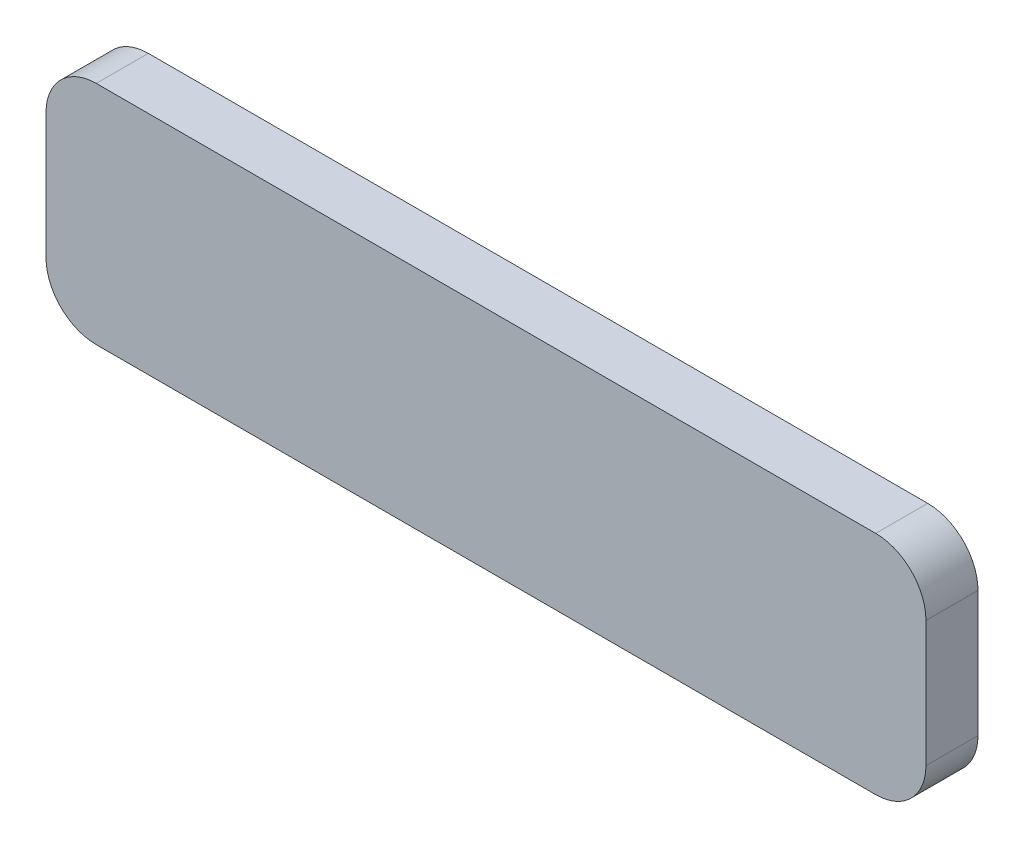
ISO-10303-21;
HEADER;
FILE_DESCRIPTION(('STEP AP214'),'2;1');
FILE_NAME('part.step','',(''),(''),'','','');
FILE_SCHEMA(('AUTOMOTIVE_DESIGN { 1 0 10303 214 1 1 1 1 }'));
ENDSEC;
DATA;
#1=APPLICATION_CONTEXT('core data for automotive mechanical design processes');
#2=APPLICATION_PROTOCOL_DEFINITION('international standard','automotive_design',2000,#1);
#3=PRODUCT_CONTEXT('',#1,'mechanical');
#4=PRODUCT('Part','Part','',(#3));
#5=PRODUCT_RELATED_PRODUCT_CATEGORY('part','',(#4));
#6=PRODUCT_DEFINITION_FORMATION('','',#4);
#7=PRODUCT_DEFINITION_CONTEXT('part definition',#1,'design');
#8=PRODUCT_DEFINITION('design','',#6,#7);
#9=PRODUCT_DEFINITION_SHAPE('','',#8);
#10=(LENGTH_UNIT() NAMED_UNIT(*) SI_UNIT(.MILLI.,.METRE.));
#11=(NAMED_UNIT(*) PLANE_ANGLE_UNIT() SI_UNIT($,.RADIAN.));
#12=(NAMED_UNIT(*) SI_UNIT($,.STERADIAN.) SOLID_ANGLE_UNIT());
#13=UNCERTAINTY_MEASURE_WITH_UNIT(LENGTH_MEASURE(1.E-05),#10,'distance_accuracy_value','');
#14=(GEOMETRIC_REPRESENTATION_CONTEXT(3) GLOBAL_UNCERTAINTY_ASSIGNED_CONTEXT((#13)) GLOBAL_UNIT_ASSIGNED_CONTEXT((#10,
#11,#12)) REPRESENTATION_CONTEXT('',''));
#15=CARTESIAN_POINT('',(0.,0.,0.));
#16=DIRECTION('',(0.,0.,1.));
#17=DIRECTION('',(1.,0.,0.));
#18=AXIS2_PLACEMENT_3D('',#15,#16,#17);
#19=CARTESIAN_POINT('',(-39.37,-6.35,5.2578));
#20=DIRECTION('',(0.,0.,1.));
#21=DIRECTION('',(1.,0.,0.));
#22=AXIS2_PLACEMENT_3D('',#19,#20,#21);
#23=CYLINDRICAL_SURFACE('',#22,5.08);
#24=DIRECTION('',(0.,0.,1.));
#25=VECTOR('',#24,1.);
#26=CARTESIAN_POINT('',(-44.45,-6.35,5.2578));
#27=LINE('',#26,#25);
#28=CARTESIAN_POINT('',(-44.45,-6.35,0.));
#29=VERTEX_POINT('',#28);
#30=CARTESIAN_POINT('',(-44.45,-6.35,5.2578));
#31=VERTEX_POINT('',#30);
#32=EDGE_CURVE('E160',#29,#31,#27,.T.);
#33=ORIENTED_EDGE('',*,*,#32,.F.);
#34=CARTESIAN_POINT('',(-39.37,-6.35,0.));
#35=DIRECTION('',(0.,0.,-1.));
#36=DIRECTION('',(-1.,0.,0.));
#37=AXIS2_PLACEMENT_3D('',#34,#35,#36);
#38=CIRCLE('',#37,5.08);
#39=CARTESIAN_POINT('',(-39.37,-11.43,0.));
#40=VERTEX_POINT('',#39);
#41=EDGE_CURVE('E50',#40,#29,#38,.T.);
#42=ORIENTED_EDGE('',*,*,#41,.F.);
#43=DIRECTION('',(0.,0.,1.));
#44=VECTOR('',#43,1.);
#45=CARTESIAN_POINT('',(-39.37,-11.43,5.2578));
#46=LINE('',#45,#44);
#47=CARTESIAN_POINT('',(-39.37,-11.43,5.2578));
#48=VERTEX_POINT('',#47);
#49=EDGE_CURVE('E163',#48,#40,#46,.F.);
#50=ORIENTED_EDGE('',*,*,#49,.F.);
#51=CARTESIAN_POINT('',(-39.37,-6.35,5.2578));
#52=DIRECTION('',(0.,0.,-1.));
#53=DIRECTION('',(-1.,0.,0.));
#54=AXIS2_PLACEMENT_3D('',#51,#52,#53);
#55=CIRCLE('',#54,5.08);
#56=EDGE_CURVE('E13',#31,#48,#55,.F.);
#57=ORIENTED_EDGE('',*,*,#56,.F.);
#58=EDGE_LOOP('',(#33,#42,#50,#57));
#59=FACE_BOUND('',#58,.T.);
#60=ADVANCED_FACE('F43',(#59),#23,.T.);
#61=CARTESIAN_POINT('',(39.37,-6.35,5.2578));
#62=DIRECTION('',(0.,0.,-1.));
#63=DIRECTION('',(-1.,0.,0.));
#64=AXIS2_PLACEMENT_3D('',#61,#62,#63);
#65=CYLINDRICAL_SURFACE('',#64,5.08);
#66=DIRECTION('',(0.,0.,-1.));
#67=VECTOR('',#66,1.);
#68=CARTESIAN_POINT('',(44.45,-6.35,5.2578));
#69=LINE('',#68,#67);
#70=CARTESIAN_POINT('',(44.45,-6.35,5.2578));
#71=VERTEX_POINT('',#70);
#72=CARTESIAN_POINT('',(44.45,-6.35,0.));
#73=VERTEX_POINT('',#72);
#74=EDGE_CURVE('E149',#71,#73,#69,.T.);
#75=ORIENTED_EDGE('',*,*,#74,.F.);
#76=CARTESIAN_POINT('',(39.37,-6.35,5.2578));
#77=DIRECTION('',(0.,0.,-1.));
#78=DIRECTION('',(-1.,0.,0.));
#79=AXIS2_PLACEMENT_3D('',#76,#77,#78);
#80=CIRCLE('',#79,5.08);
#81=CARTESIAN_POINT('',(39.37,-11.43,5.2578));
#82=VERTEX_POINT('',#81);
#83=EDGE_CURVE('E155',#82,#71,#80,.F.);
#84=ORIENTED_EDGE('',*,*,#83,.F.);
#85=DIRECTION('',(0.,0.,-1.));
#86=VECTOR('',#85,1.);
#87=CARTESIAN_POINT('',(39.37,-11.43,5.2578));
#88=LINE('',#87,#86);
#89=CARTESIAN_POINT('',(39.37,-11.43,0.));
#90=VERTEX_POINT('',#89);
#91=EDGE_CURVE('E152',#90,#82,#88,.F.);
#92=ORIENTED_EDGE('',*,*,#91,.F.);
#93=CARTESIAN_POINT('',(39.37,-6.35,0.));
#94=DIRECTION('',(0.,0.,-1.));
#95=DIRECTION('',(-1.,0.,0.));
#96=AXIS2_PLACEMENT_3D('',#93,#94,#95);
#97=CIRCLE('',#96,5.08);
#98=EDGE_CURVE('E157',#73,#90,#97,.T.);
#99=ORIENTED_EDGE('',*,*,#98,.F.);
#100=EDGE_LOOP('',(#75,#84,#92,#99));
#101=FACE_BOUND('',#100,.T.);
#102=ADVANCED_FACE('F186',(#101),#65,.T.);
#103=CARTESIAN_POINT('',(39.37,6.35,5.2578));
#104=DIRECTION('',(0.,0.,-1.));
#105=DIRECTION('',(-1.,0.,0.));
#106=AXIS2_PLACEMENT_3D('',#103,#104,#105);
#107=CYLINDRICAL_SURFACE('',#106,5.08);
#108=DIRECTION('',(0.,0.,-1.));
#109=VECTOR('',#108,1.);
#110=CARTESIAN_POINT('',(39.37,11.43,5.2578));
#111=LINE('',#110,#109);
#112=CARTESIAN_POINT('',(39.37,11.43,5.2578));
#113=VERTEX_POINT('',#112);
#114=CARTESIAN_POINT('',(39.37,11.43,0.));
#115=VERTEX_POINT('',#114);
#116=EDGE_CURVE('E112',#113,#115,#111,.T.);
#117=ORIENTED_EDGE('',*,*,#116,.F.);
#118=CARTESIAN_POINT('',(39.37,6.35,5.2578));
#119=DIRECTION('',(0.,0.,-1.));
#120=DIRECTION('',(-1.,0.,0.));
#121=AXIS2_PLACEMENT_3D('',#118,#119,#120);
#122=CIRCLE('',#121,5.08);
#123=CARTESIAN_POINT('',(44.45,6.35,5.2578));
#124=VERTEX_POINT('',#123);
#125=EDGE_CURVE('E145',#124,#113,#122,.F.);
#126=ORIENTED_EDGE('',*,*,#125,.F.);
#127=DIRECTION('',(0.,0.,-1.));
#128=VECTOR('',#127,1.);
#129=CARTESIAN_POINT('',(44.45,6.35,5.2578));
#130=LINE('',#129,#128);
#131=CARTESIAN_POINT('',(44.45,6.35,0.));
#132=VERTEX_POINT('',#131);
#133=EDGE_CURVE('E142',#132,#124,#130,.F.);
#134=ORIENTED_EDGE('',*,*,#133,.F.);
#135=CARTESIAN_POINT('',(39.37,6.35,0.));
#136=DIRECTION('',(0.,0.,-1.));
#137=DIRECTION('',(-1.,0.,0.));
#138=AXIS2_PLACEMENT_3D('',#135,#136,#137);
#139=CIRCLE('',#138,5.08);
#140=EDGE_CURVE('E147',#115,#132,#139,.T.);
#141=ORIENTED_EDGE('',*,*,#140,.F.);
#142=EDGE_LOOP('',(#117,#126,#134,#141));
#143=FACE_BOUND('',#142,.T.);
#144=ADVANCED_FACE('F181',(#143),#107,.T.);
#145=CARTESIAN_POINT('',(-39.37,6.35,5.2578));
#146=DIRECTION('',(0.,0.,1.));
#147=DIRECTION('',(1.,0.,0.));
#148=AXIS2_PLACEMENT_3D('',#145,#146,#147);
#149=CYLINDRICAL_SURFACE('',#148,5.08);
#150=DIRECTION('',(0.,0.,1.));
#151=VECTOR('',#150,1.);
#152=CARTESIAN_POINT('',(-39.37,11.43,5.2578));
#153=LINE('',#152,#151);
#154=CARTESIAN_POINT('',(-39.37,11.43,0.));
#155=VERTEX_POINT('',#154);
#156=CARTESIAN_POINT('',(-39.37,11.43,5.2578));
#157=VERTEX_POINT('',#156);
#158=EDGE_CURVE('E110',#155,#157,#153,.T.);
#159=ORIENTED_EDGE('',*,*,#158,.F.);
#160=CARTESIAN_POINT('',(-39.37,6.35,0.));
#161=DIRECTION('',(0.,0.,-1.));
#162=DIRECTION('',(-1.,0.,0.));
#163=AXIS2_PLACEMENT_3D('',#160,#161,#162);
#164=CIRCLE('',#163,5.08);
#165=CARTESIAN_POINT('',(-44.45,6.35,0.));
#166=VERTEX_POINT('',#165);
#167=EDGE_CURVE('E119',#166,#155,#164,.T.);
#168=ORIENTED_EDGE('',*,*,#167,.F.);
#169=DIRECTION('',(0.,0.,1.));
#170=VECTOR('',#169,1.);
#171=CARTESIAN_POINT('',(-44.45,6.35,5.2578));
#172=LINE('',#171,#170);
#173=CARTESIAN_POINT('',(-44.45,6.35,5.2578));
#174=VERTEX_POINT('',#173);
#175=EDGE_CURVE('E127',#174,#166,#172,.F.);
#176=ORIENTED_EDGE('',*,*,#175,.F.);
#177=CARTESIAN_POINT('',(-39.37,6.35,5.2578));
#178=DIRECTION('',(0.,0.,-1.));
#179=DIRECTION('',(-1.,0.,0.));
#180=AXIS2_PLACEMENT_3D('',#177,#178,#179);
#181=CIRCLE('',#180,5.08);
#182=EDGE_CURVE('E126',#157,#174,#181,.F.);
#183=ORIENTED_EDGE('',*,*,#182,.F.);
#184=EDGE_LOOP('',(#159,#168,#176,#183));
#185=FACE_BOUND('',#184,.T.);
#186=ADVANCED_FACE('F130',(#185),#149,.T.);
#187=CARTESIAN_POINT('',(44.45,-11.43,5.2578));
#188=DIRECTION('',(-1.,0.,0.));
#189=DIRECTION('',(0.,0.,1.));
#190=AXIS2_PLACEMENT_3D('',#187,#188,#189);
#191=PLANE('',#190);
#192=DIRECTION('',(0.,1.,0.));
#193=VECTOR('',#192,1.);
#194=CARTESIAN_POINT('',(44.45,-11.43,5.2578));
#195=LINE('',#194,#193);
#196=EDGE_CURVE('E167',#71,#124,#195,.T.);
#197=ORIENTED_EDGE('',*,*,#196,.F.);
#198=ORIENTED_EDGE('',*,*,#74,.T.);
#199=DIRECTION('',(0.,1.,0.));
#200=VECTOR('',#199,1.);
#201=CARTESIAN_POINT('',(44.45,-11.43,0.));
#202=LINE('',#201,#200);
#203=EDGE_CURVE('E116',#73,#132,#202,.T.);
#204=ORIENTED_EDGE('',*,*,#203,.T.);
#205=ORIENTED_EDGE('',*,*,#133,.T.);
#206=EDGE_LOOP('',(#197,#198,#204,#205));
#207=FACE_BOUND('',#206,.T.);
#208=ADVANCED_FACE('F182',(#207),#191,.F.);
#209=CARTESIAN_POINT('',(-44.45,11.43,5.2578));
#210=DIRECTION('',(0.,-1.,0.));
#211=DIRECTION('',(0.,0.,-1.));
#212=AXIS2_PLACEMENT_3D('',#209,#210,#211);
#213=PLANE('',#212);
#214=DIRECTION('',(-1.,0.,0.));
#215=VECTOR('',#214,1.);
#216=CARTESIAN_POINT('',(-44.45,11.43,5.2578));
#217=LINE('',#216,#215);
#218=EDGE_CURVE('E171',#113,#157,#217,.T.);
#219=ORIENTED_EDGE('',*,*,#218,.F.);
#220=ORIENTED_EDGE('',*,*,#116,.T.);
#221=DIRECTION('',(-1.,0.,0.));
#222=VECTOR('',#221,1.);
#223=CARTESIAN_POINT('',(-44.45,11.43,0.));
#224=LINE('',#223,#222);
#225=EDGE_CURVE('E105',#115,#155,#224,.T.);
#226=ORIENTED_EDGE('',*,*,#225,.T.);
#227=ORIENTED_EDGE('',*,*,#158,.T.);
#228=EDGE_LOOP('',(#219,#220,#226,#227));
#229=FACE_BOUND('',#228,.T.);
#230=ADVANCED_FACE('F108',(#229),#213,.F.);
#231=CARTESIAN_POINT('',(-44.45,-11.43,5.2578));
#232=DIRECTION('',(1.,0.,0.));
#233=DIRECTION('',(0.,0.,-1.));
#234=AXIS2_PLACEMENT_3D('',#231,#232,#233);
#235=PLANE('',#234);
#236=DIRECTION('',(0.,-1.,0.));
#237=VECTOR('',#236,1.);
#238=CARTESIAN_POINT('',(-44.45,-11.43,0.));
#239=LINE('',#238,#237);
#240=EDGE_CURVE('E115',#166,#29,#239,.T.);
#241=ORIENTED_EDGE('',*,*,#240,.T.);
#242=ORIENTED_EDGE('',*,*,#32,.T.);
#243=DIRECTION('',(0.,-1.,0.));
#244=VECTOR('',#243,1.);
#245=CARTESIAN_POINT('',(-44.45,-11.43,5.2578));
#246=LINE('',#245,#244);
#247=EDGE_CURVE('E134',#174,#31,#246,.T.);
#248=ORIENTED_EDGE('',*,*,#247,.F.);
#249=ORIENTED_EDGE('',*,*,#175,.T.);
#250=EDGE_LOOP('',(#241,#242,#248,#249));
#251=FACE_BOUND('',#250,.T.);
#252=ADVANCED_FACE('F166',(#251),#235,.F.);
#253=CARTESIAN_POINT('',(-44.45,-11.43,5.2578));
#254=DIRECTION('',(0.,1.,0.));
#255=DIRECTION('',(0.,0.,1.));
#256=AXIS2_PLACEMENT_3D('',#253,#254,#255);
#257=PLANE('',#256);
#258=DIRECTION('',(1.,0.,0.));
#259=VECTOR('',#258,1.);
#260=CARTESIAN_POINT('',(-44.45,-11.43,5.2578));
#261=LINE('',#260,#259);
#262=EDGE_CURVE('E131',#48,#82,#261,.T.);
#263=ORIENTED_EDGE('',*,*,#262,.F.);
#264=ORIENTED_EDGE('',*,*,#49,.T.);
#265=DIRECTION('',(1.,0.,0.));
#266=VECTOR('',#265,1.);
#267=CARTESIAN_POINT('',(-44.45,-11.43,0.));
#268=LINE('',#267,#266);
#269=EDGE_CURVE('E137',#40,#90,#268,.T.);
#270=ORIENTED_EDGE('',*,*,#269,.T.);
#271=ORIENTED_EDGE('',*,*,#91,.T.);
#272=EDGE_LOOP('',(#263,#264,#270,#271));
#273=FACE_BOUND('',#272,.T.);
#274=ADVANCED_FACE('F189',(#273),#257,.F.);
#275=CARTESIAN_POINT('',(44.45,11.43,5.2578));
#276=DIRECTION('',(0.,0.,-1.));
#277=DIRECTION('',(-1.,0.,0.));
#278=AXIS2_PLACEMENT_3D('',#275,#276,#277);
#279=PLANE('',#278);
#280=ORIENTED_EDGE('',*,*,#247,.T.);
#281=ORIENTED_EDGE('',*,*,#56,.T.);
#282=ORIENTED_EDGE('',*,*,#262,.T.);
#283=ORIENTED_EDGE('',*,*,#83,.T.);
#284=ORIENTED_EDGE('',*,*,#196,.T.);
#285=ORIENTED_EDGE('',*,*,#125,.T.);
#286=ORIENTED_EDGE('',*,*,#218,.T.);
#287=ORIENTED_EDGE('',*,*,#182,.T.);
#288=EDGE_LOOP('',(#280,#281,#282,#283,#284,#285,#286,#287));
#289=FACE_BOUND('',#288,.T.);
#290=ADVANCED_FACE('F175',(#289),#279,.F.);
#291=CARTESIAN_POINT('',(44.45,11.43,0.));
#292=DIRECTION('',(0.,0.,-1.));
#293=DIRECTION('',(-1.,0.,0.));
#294=AXIS2_PLACEMENT_3D('',#291,#292,#293);
#295=PLANE('',#294);
#296=ORIENTED_EDGE('',*,*,#269,.F.);
#297=ORIENTED_EDGE('',*,*,#41,.T.);
#298=ORIENTED_EDGE('',*,*,#240,.F.);
#299=ORIENTED_EDGE('',*,*,#167,.T.);
#300=ORIENTED_EDGE('',*,*,#225,.F.);
#301=ORIENTED_EDGE('',*,*,#140,.T.);
#302=ORIENTED_EDGE('',*,*,#203,.F.);
#303=ORIENTED_EDGE('',*,*,#98,.T.);
#304=EDGE_LOOP('',(#296,#297,#298,#299,#300,#301,#302,#303));
#305=FACE_BOUND('',#304,.T.);
#306=ADVANCED_FACE('F121',(#305),#295,.T.);
#307=CLOSED_SHELL('',(#60,#102,#144,#186,#208,#230,#252,#274,#290,#306));
#308=MANIFOLD_SOLID_BREP('B2',#307);
#309=ADVANCED_BREP_SHAPE_REPRESENTATION('',(#18,#308),#14);
#310=SHAPE_DEFINITION_REPRESENTATION(#9,#309);
ENDSEC;
END-ISO-10303-21;
